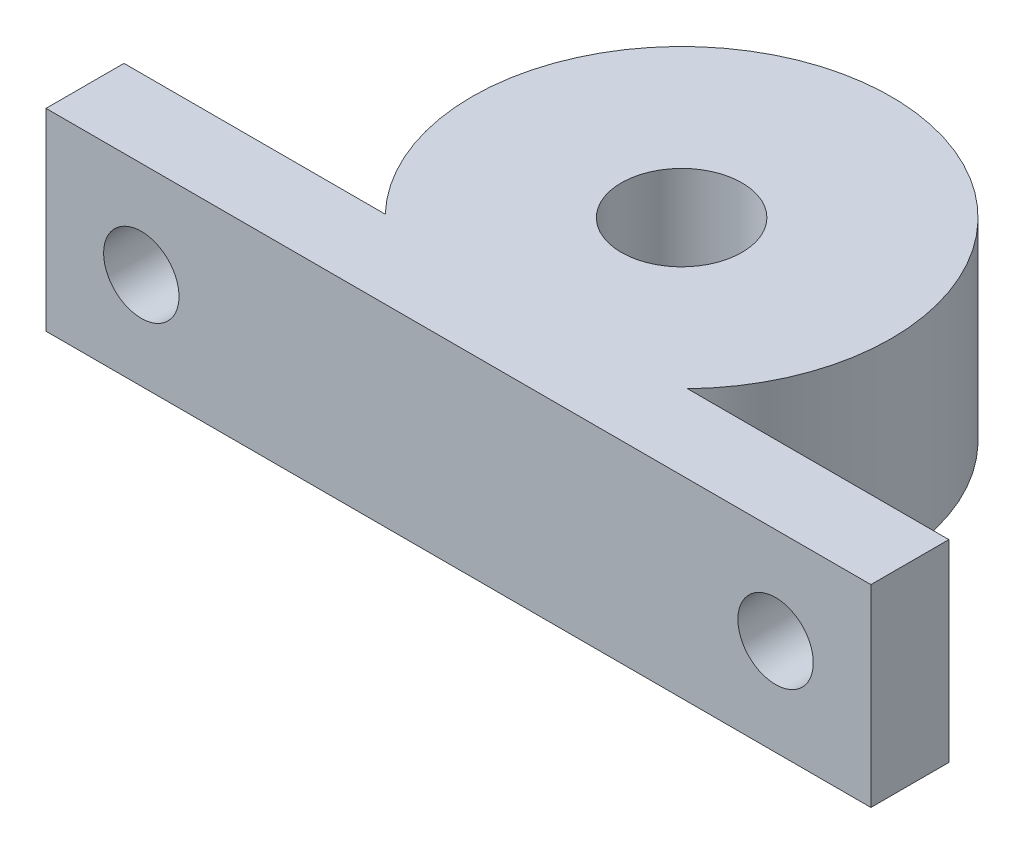
ISO-10303-21;
HEADER;
FILE_DESCRIPTION(('STEP AP214'),'2;1');
FILE_NAME('part.step','',(''),(''),'','','');
FILE_SCHEMA(('AUTOMOTIVE_DESIGN { 1 0 10303 214 1 1 1 1 }'));
ENDSEC;
DATA;
#1=APPLICATION_CONTEXT('core data for automotive mechanical design processes');
#2=APPLICATION_PROTOCOL_DEFINITION('international standard','automotive_design',2000,#1);
#3=PRODUCT_CONTEXT('',#1,'mechanical');
#4=PRODUCT('Part','Part','',(#3));
#5=PRODUCT_RELATED_PRODUCT_CATEGORY('part','',(#4));
#6=PRODUCT_DEFINITION_FORMATION('','',#4);
#7=PRODUCT_DEFINITION_CONTEXT('part definition',#1,'design');
#8=PRODUCT_DEFINITION('design','',#6,#7);
#9=PRODUCT_DEFINITION_SHAPE('','',#8);
#10=(LENGTH_UNIT() NAMED_UNIT(*) SI_UNIT(.MILLI.,.METRE.));
#11=(NAMED_UNIT(*) PLANE_ANGLE_UNIT() SI_UNIT($,.RADIAN.));
#12=(NAMED_UNIT(*) SI_UNIT($,.STERADIAN.) SOLID_ANGLE_UNIT());
#13=UNCERTAINTY_MEASURE_WITH_UNIT(LENGTH_MEASURE(1.E-05),#10,'distance_accuracy_value','');
#14=(GEOMETRIC_REPRESENTATION_CONTEXT(3) GLOBAL_UNCERTAINTY_ASSIGNED_CONTEXT((#13)) GLOBAL_UNIT_ASSIGNED_CONTEXT((#10,
#11,#12)) REPRESENTATION_CONTEXT('',''));
#15=CARTESIAN_POINT('',(0.,0.,0.));
#16=DIRECTION('',(0.,0.,1.));
#17=DIRECTION('',(1.,0.,0.));
#18=AXIS2_PLACEMENT_3D('',#15,#16,#17);
#19=CARTESIAN_POINT('',(27.35,12.8,-14.8));
#20=DIRECTION('',(0.,1.,0.));
#21=DIRECTION('',(0.,0.,1.));
#22=AXIS2_PLACEMENT_3D('',#19,#20,#21);
#23=PLANE('',#22);
#24=DIRECTION('',(0.,0.,1.));
#25=VECTOR('',#24,1.);
#26=CARTESIAN_POINT('',(0.,12.8,0.));
#27=LINE('',#26,#25);
#28=CARTESIAN_POINT('',(0.,12.8,-5.17));
#29=VERTEX_POINT('',#28);
#30=CARTESIAN_POINT('',(0.,12.8,0.));
#31=VERTEX_POINT('',#30);
#32=EDGE_CURVE('E128',#29,#31,#27,.T.);
#33=ORIENTED_EDGE('',*,*,#32,.T.);
#34=DIRECTION('',(1.,0.,0.));
#35=VECTOR('',#34,1.);
#36=CARTESIAN_POINT('',(0.,12.8,0.));
#37=LINE('',#36,#35);
#38=CARTESIAN_POINT('',(54.7,12.8,0.));
#39=VERTEX_POINT('',#38);
#40=EDGE_CURVE('E86',#31,#39,#37,.T.);
#41=ORIENTED_EDGE('',*,*,#40,.T.);
#42=DIRECTION('',(0.,0.,-1.));
#43=VECTOR('',#42,1.);
#44=CARTESIAN_POINT('',(54.7,12.8,0.));
#45=LINE('',#44,#43);
#46=CARTESIAN_POINT('',(54.7,12.8,-5.17));
#47=VERTEX_POINT('',#46);
#48=EDGE_CURVE('E99',#39,#47,#45,.T.);
#49=ORIENTED_EDGE('',*,*,#48,.T.);
#50=DIRECTION('',(-1.,0.,0.));
#51=VECTOR('',#50,1.);
#52=CARTESIAN_POINT('',(37.3736270880356,12.8,-5.17));
#53=LINE('',#52,#51);
#54=CARTESIAN_POINT('',(37.3736270880356,12.8,-5.17));
#55=VERTEX_POINT('',#54);
#56=EDGE_CURVE('E93',#47,#55,#53,.T.);
#57=ORIENTED_EDGE('',*,*,#56,.T.);
#58=CARTESIAN_POINT('',(27.35,12.8,-14.8));
#59=DIRECTION('',(0.,1.,0.));
#60=DIRECTION('',(0.,0.,1.));
#61=AXIS2_PLACEMENT_3D('',#58,#59,#60);
#62=CIRCLE('',#61,13.9);
#63=CARTESIAN_POINT('',(17.3263729119644,12.8,-5.17000000000001));
#64=VERTEX_POINT('',#63);
#65=EDGE_CURVE('E97',#55,#64,#62,.T.);
#66=ORIENTED_EDGE('',*,*,#65,.T.);
#67=DIRECTION('',(-1.,0.,0.));
#68=VECTOR('',#67,1.);
#69=CARTESIAN_POINT('',(0.,12.8,-5.17));
#70=LINE('',#69,#68);
#71=EDGE_CURVE('E49',#64,#29,#70,.T.);
#72=ORIENTED_EDGE('',*,*,#71,.T.);
#73=EDGE_LOOP('',(#33,#41,#49,#57,#66,#72));
#74=FACE_BOUND('',#73,.T.);
#75=CARTESIAN_POINT('',(27.35,12.8,-14.8));
#76=DIRECTION('',(0.,1.,0.));
#77=DIRECTION('',(0.,0.,1.));
#78=AXIS2_PLACEMENT_3D('',#75,#76,#77);
#79=CIRCLE('',#78,4.);
#80=CARTESIAN_POINT('',(27.35,12.8,-10.8));
#81=VERTEX_POINT('',#80);
#82=EDGE_CURVE('E121',#81,#81,#79,.T.);
#83=ORIENTED_EDGE('',*,*,#82,.F.);
#84=EDGE_LOOP('',(#83));
#85=FACE_BOUND('',#84,.T.);
#86=ADVANCED_FACE('F32',(#74,#85),#23,.T.);
#87=CARTESIAN_POINT('',(27.35,0.,-14.8));
#88=DIRECTION('',(0.,1.,0.));
#89=DIRECTION('',(0.,0.,1.));
#90=AXIS2_PLACEMENT_3D('',#87,#88,#89);
#91=PLANE('',#90);
#92=DIRECTION('',(0.,0.,1.));
#93=VECTOR('',#92,1.);
#94=CARTESIAN_POINT('',(0.,0.,0.));
#95=LINE('',#94,#93);
#96=CARTESIAN_POINT('',(0.,0.,-5.17));
#97=VERTEX_POINT('',#96);
#98=CARTESIAN_POINT('',(0.,0.,0.));
#99=VERTEX_POINT('',#98);
#100=EDGE_CURVE('E117',#97,#99,#95,.T.);
#101=ORIENTED_EDGE('',*,*,#100,.F.);
#102=DIRECTION('',(-1.,0.,0.));
#103=VECTOR('',#102,1.);
#104=CARTESIAN_POINT('',(0.,0.,-5.17));
#105=LINE('',#104,#103);
#106=CARTESIAN_POINT('',(17.3263729119644,0.,-5.17000000000001));
#107=VERTEX_POINT('',#106);
#108=EDGE_CURVE('E78',#107,#97,#105,.T.);
#109=ORIENTED_EDGE('',*,*,#108,.F.);
#110=CARTESIAN_POINT('',(27.35,0.,-14.8));
#111=DIRECTION('',(0.,1.,0.));
#112=DIRECTION('',(0.,0.,1.));
#113=AXIS2_PLACEMENT_3D('',#110,#111,#112);
#114=CIRCLE('',#113,13.9);
#115=CARTESIAN_POINT('',(37.3736270880356,0.,-5.17));
#116=VERTEX_POINT('',#115);
#117=EDGE_CURVE('E72',#116,#107,#114,.T.);
#118=ORIENTED_EDGE('',*,*,#117,.F.);
#119=DIRECTION('',(-1.,0.,0.));
#120=VECTOR('',#119,1.);
#121=CARTESIAN_POINT('',(37.3736270880356,0.,-5.17));
#122=LINE('',#121,#120);
#123=CARTESIAN_POINT('',(54.7,0.,-5.17));
#124=VERTEX_POINT('',#123);
#125=EDGE_CURVE('E107',#124,#116,#122,.T.);
#126=ORIENTED_EDGE('',*,*,#125,.F.);
#127=DIRECTION('',(0.,0.,-1.));
#128=VECTOR('',#127,1.);
#129=CARTESIAN_POINT('',(54.7,0.,0.));
#130=LINE('',#129,#128);
#131=CARTESIAN_POINT('',(54.7,0.,0.));
#132=VERTEX_POINT('',#131);
#133=EDGE_CURVE('E123',#132,#124,#130,.T.);
#134=ORIENTED_EDGE('',*,*,#133,.F.);
#135=DIRECTION('',(1.,0.,0.));
#136=VECTOR('',#135,1.);
#137=CARTESIAN_POINT('',(0.,0.,0.));
#138=LINE('',#137,#136);
#139=EDGE_CURVE('E120',#99,#132,#138,.T.);
#140=ORIENTED_EDGE('',*,*,#139,.F.);
#141=EDGE_LOOP('',(#101,#109,#118,#126,#134,#140));
#142=FACE_BOUND('',#141,.T.);
#143=CARTESIAN_POINT('',(27.35,0.,-14.8));
#144=DIRECTION('',(0.,1.,0.));
#145=DIRECTION('',(0.,0.,1.));
#146=AXIS2_PLACEMENT_3D('',#143,#144,#145);
#147=CIRCLE('',#146,4.);
#148=CARTESIAN_POINT('',(27.35,0.,-10.8));
#149=VERTEX_POINT('',#148);
#150=EDGE_CURVE('E181',#149,#149,#147,.T.);
#151=ORIENTED_EDGE('',*,*,#150,.T.);
#152=EDGE_LOOP('',(#151));
#153=FACE_BOUND('',#152,.T.);
#154=ADVANCED_FACE('F137',(#142,#153),#91,.F.);
#155=CARTESIAN_POINT('',(0.,12.8,0.));
#156=DIRECTION('',(1.,0.,0.));
#157=DIRECTION('',(0.,0.,-1.));
#158=AXIS2_PLACEMENT_3D('',#155,#156,#157);
#159=PLANE('',#158);
#160=ORIENTED_EDGE('',*,*,#100,.T.);
#161=DIRECTION('',(0.,-1.,0.));
#162=VECTOR('',#161,1.);
#163=CARTESIAN_POINT('',(0.,12.8,0.));
#164=LINE('',#163,#162);
#165=EDGE_CURVE('E11',#31,#99,#164,.T.);
#166=ORIENTED_EDGE('',*,*,#165,.F.);
#167=ORIENTED_EDGE('',*,*,#32,.F.);
#168=DIRECTION('',(0.,-1.,0.));
#169=VECTOR('',#168,1.);
#170=CARTESIAN_POINT('',(0.,12.8,-5.17));
#171=LINE('',#170,#169);
#172=EDGE_CURVE('E113',#29,#97,#171,.T.);
#173=ORIENTED_EDGE('',*,*,#172,.T.);
#174=EDGE_LOOP('',(#160,#166,#167,#173));
#175=FACE_BOUND('',#174,.T.);
#176=ADVANCED_FACE('F34',(#175),#159,.F.);
#177=CARTESIAN_POINT('',(0.,12.8,0.));
#178=DIRECTION('',(0.,0.,-1.));
#179=DIRECTION('',(-1.,0.,0.));
#180=AXIS2_PLACEMENT_3D('',#177,#178,#179);
#181=PLANE('',#180);
#182=CARTESIAN_POINT('',(48.38,6.4,0.));
#183=DIRECTION('',(0.,0.,-1.));
#184=DIRECTION('',(-1.,0.,0.));
#185=AXIS2_PLACEMENT_3D('',#182,#183,#184);
#186=CIRCLE('',#185,2.5);
#187=CARTESIAN_POINT('',(45.88,6.4,0.));
#188=VERTEX_POINT('',#187);
#189=EDGE_CURVE('E174',#188,#188,#186,.T.);
#190=ORIENTED_EDGE('',*,*,#189,.T.);
#191=EDGE_LOOP('',(#190));
#192=FACE_BOUND('',#191,.T.);
#193=CARTESIAN_POINT('',(6.32,6.4,0.));
#194=DIRECTION('',(0.,0.,-1.));
#195=DIRECTION('',(-1.,0.,0.));
#196=AXIS2_PLACEMENT_3D('',#193,#194,#195);
#197=CIRCLE('',#196,2.5);
#198=CARTESIAN_POINT('',(3.82,6.4,0.));
#199=VERTEX_POINT('',#198);
#200=EDGE_CURVE('E179',#199,#199,#197,.T.);
#201=ORIENTED_EDGE('',*,*,#200,.T.);
#202=EDGE_LOOP('',(#201));
#203=FACE_BOUND('',#202,.T.);
#204=ORIENTED_EDGE('',*,*,#139,.T.);
#205=DIRECTION('',(0.,-1.,0.));
#206=VECTOR('',#205,1.);
#207=CARTESIAN_POINT('',(54.7,12.8,0.));
#208=LINE('',#207,#206);
#209=EDGE_CURVE('E41',#39,#132,#208,.T.);
#210=ORIENTED_EDGE('',*,*,#209,.F.);
#211=ORIENTED_EDGE('',*,*,#40,.F.);
#212=ORIENTED_EDGE('',*,*,#165,.T.);
#213=EDGE_LOOP('',(#204,#210,#211,#212));
#214=FACE_BOUND('',#213,.T.);
#215=ADVANCED_FACE('F200',(#192,#203,#214),#181,.F.);
#216=CARTESIAN_POINT('',(54.7,12.8,0.));
#217=DIRECTION('',(-1.,0.,0.));
#218=DIRECTION('',(0.,0.,1.));
#219=AXIS2_PLACEMENT_3D('',#216,#217,#218);
#220=PLANE('',#219);
#221=ORIENTED_EDGE('',*,*,#133,.T.);
#222=DIRECTION('',(0.,-1.,0.));
#223=VECTOR('',#222,1.);
#224=CARTESIAN_POINT('',(54.7,12.8,-5.17));
#225=LINE('',#224,#223);
#226=EDGE_CURVE('E108',#47,#124,#225,.T.);
#227=ORIENTED_EDGE('',*,*,#226,.F.);
#228=ORIENTED_EDGE('',*,*,#48,.F.);
#229=ORIENTED_EDGE('',*,*,#209,.T.);
#230=EDGE_LOOP('',(#221,#227,#228,#229));
#231=FACE_BOUND('',#230,.T.);
#232=ADVANCED_FACE('F134',(#231),#220,.F.);
#233=CARTESIAN_POINT('',(37.3736270880356,12.8,-5.17));
#234=DIRECTION('',(0.,0.,1.));
#235=DIRECTION('',(1.,0.,0.));
#236=AXIS2_PLACEMENT_3D('',#233,#234,#235);
#237=PLANE('',#236);
#238=CARTESIAN_POINT('',(48.38,6.4,-5.17));
#239=DIRECTION('',(0.,0.,-1.));
#240=DIRECTION('',(-1.,0.,0.));
#241=AXIS2_PLACEMENT_3D('',#238,#239,#240);
#242=CIRCLE('',#241,2.5);
#243=CARTESIAN_POINT('',(45.88,6.4,-5.17));
#244=VERTEX_POINT('',#243);
#245=EDGE_CURVE('E177',#244,#244,#242,.T.);
#246=ORIENTED_EDGE('',*,*,#245,.F.);
#247=EDGE_LOOP('',(#246));
#248=FACE_BOUND('',#247,.T.);
#249=ORIENTED_EDGE('',*,*,#125,.T.);
#250=DIRECTION('',(0.,-1.,0.));
#251=VECTOR('',#250,1.);
#252=CARTESIAN_POINT('',(37.3736270880356,12.8,-5.17));
#253=LINE('',#252,#251);
#254=EDGE_CURVE('E104',#55,#116,#253,.T.);
#255=ORIENTED_EDGE('',*,*,#254,.F.);
#256=ORIENTED_EDGE('',*,*,#56,.F.);
#257=ORIENTED_EDGE('',*,*,#226,.T.);
#258=EDGE_LOOP('',(#249,#255,#256,#257));
#259=FACE_BOUND('',#258,.T.);
#260=ADVANCED_FACE('F105',(#248,#259),#237,.F.);
#261=CARTESIAN_POINT('',(27.35,12.8,-14.8));
#262=DIRECTION('',(0.,-1.,0.));
#263=DIRECTION('',(0.,0.,-1.));
#264=AXIS2_PLACEMENT_3D('',#261,#262,#263);
#265=CYLINDRICAL_SURFACE('',#264,13.9);
#266=ORIENTED_EDGE('',*,*,#117,.T.);
#267=DIRECTION('',(0.,-1.,0.));
#268=VECTOR('',#267,1.);
#269=CARTESIAN_POINT('',(17.3263729119644,12.8,-5.17000000000001));
#270=LINE('',#269,#268);
#271=EDGE_CURVE('E109',#64,#107,#270,.T.);
#272=ORIENTED_EDGE('',*,*,#271,.F.);
#273=ORIENTED_EDGE('',*,*,#65,.F.);
#274=ORIENTED_EDGE('',*,*,#254,.T.);
#275=EDGE_LOOP('',(#266,#272,#273,#274));
#276=FACE_BOUND('',#275,.T.);
#277=ADVANCED_FACE('F111',(#276),#265,.T.);
#278=CARTESIAN_POINT('',(0.,12.8,-5.17));
#279=DIRECTION('',(0.,0.,1.));
#280=DIRECTION('',(1.,0.,0.));
#281=AXIS2_PLACEMENT_3D('',#278,#279,#280);
#282=PLANE('',#281);
#283=CARTESIAN_POINT('',(6.32,6.4,-5.17));
#284=DIRECTION('',(0.,0.,-1.));
#285=DIRECTION('',(-1.,0.,0.));
#286=AXIS2_PLACEMENT_3D('',#283,#284,#285);
#287=CIRCLE('',#286,2.5);
#288=CARTESIAN_POINT('',(3.82,6.4,-5.17));
#289=VERTEX_POINT('',#288);
#290=EDGE_CURVE('E184',#289,#289,#287,.T.);
#291=ORIENTED_EDGE('',*,*,#290,.F.);
#292=EDGE_LOOP('',(#291));
#293=FACE_BOUND('',#292,.T.);
#294=ORIENTED_EDGE('',*,*,#108,.T.);
#295=ORIENTED_EDGE('',*,*,#172,.F.);
#296=ORIENTED_EDGE('',*,*,#71,.F.);
#297=ORIENTED_EDGE('',*,*,#271,.T.);
#298=EDGE_LOOP('',(#294,#295,#296,#297));
#299=FACE_BOUND('',#298,.T.);
#300=ADVANCED_FACE('F142',(#293,#299),#282,.F.);
#301=CARTESIAN_POINT('',(27.35,12.8,-14.8));
#302=DIRECTION('',(0.,-1.,0.));
#303=DIRECTION('',(0.,0.,-1.));
#304=AXIS2_PLACEMENT_3D('',#301,#302,#303);
#305=CYLINDRICAL_SURFACE('',#304,4.);
#306=ORIENTED_EDGE('',*,*,#82,.T.);
#307=EDGE_LOOP('',(#306));
#308=FACE_BOUND('',#307,.T.);
#309=ORIENTED_EDGE('',*,*,#150,.F.);
#310=EDGE_LOOP('',(#309));
#311=FACE_BOUND('',#310,.T.);
#312=ADVANCED_FACE('F144',(#308,#311),#305,.F.);
#313=CARTESIAN_POINT('',(6.32,6.4,0.));
#314=DIRECTION('',(0.,0.,-1.));
#315=DIRECTION('',(-1.,0.,0.));
#316=AXIS2_PLACEMENT_3D('',#313,#314,#315);
#317=CYLINDRICAL_SURFACE('',#316,2.5);
#318=ORIENTED_EDGE('',*,*,#200,.F.);
#319=EDGE_LOOP('',(#318));
#320=FACE_BOUND('',#319,.T.);
#321=ORIENTED_EDGE('',*,*,#290,.T.);
#322=EDGE_LOOP('',(#321));
#323=FACE_BOUND('',#322,.T.);
#324=ADVANCED_FACE('F151',(#320,#323),#317,.F.);
#325=CARTESIAN_POINT('',(48.38,6.4,0.));
#326=DIRECTION('',(0.,0.,-1.));
#327=DIRECTION('',(-1.,0.,0.));
#328=AXIS2_PLACEMENT_3D('',#325,#326,#327);
#329=CYLINDRICAL_SURFACE('',#328,2.5);
#330=ORIENTED_EDGE('',*,*,#189,.F.);
#331=EDGE_LOOP('',(#330));
#332=FACE_BOUND('',#331,.T.);
#333=ORIENTED_EDGE('',*,*,#245,.T.);
#334=EDGE_LOOP('',(#333));
#335=FACE_BOUND('',#334,.T.);
#336=ADVANCED_FACE('F165',(#332,#335),#329,.F.);
#337=CLOSED_SHELL('',(#86,#154,#176,#215,#232,#260,#277,#300,#312,#324,#336));
#338=MANIFOLD_SOLID_BREP('B2',#337);
#339=ADVANCED_BREP_SHAPE_REPRESENTATION('',(#18,#338),#14);
#340=SHAPE_DEFINITION_REPRESENTATION(#9,#339);
ENDSEC;
END-ISO-10303-21;
